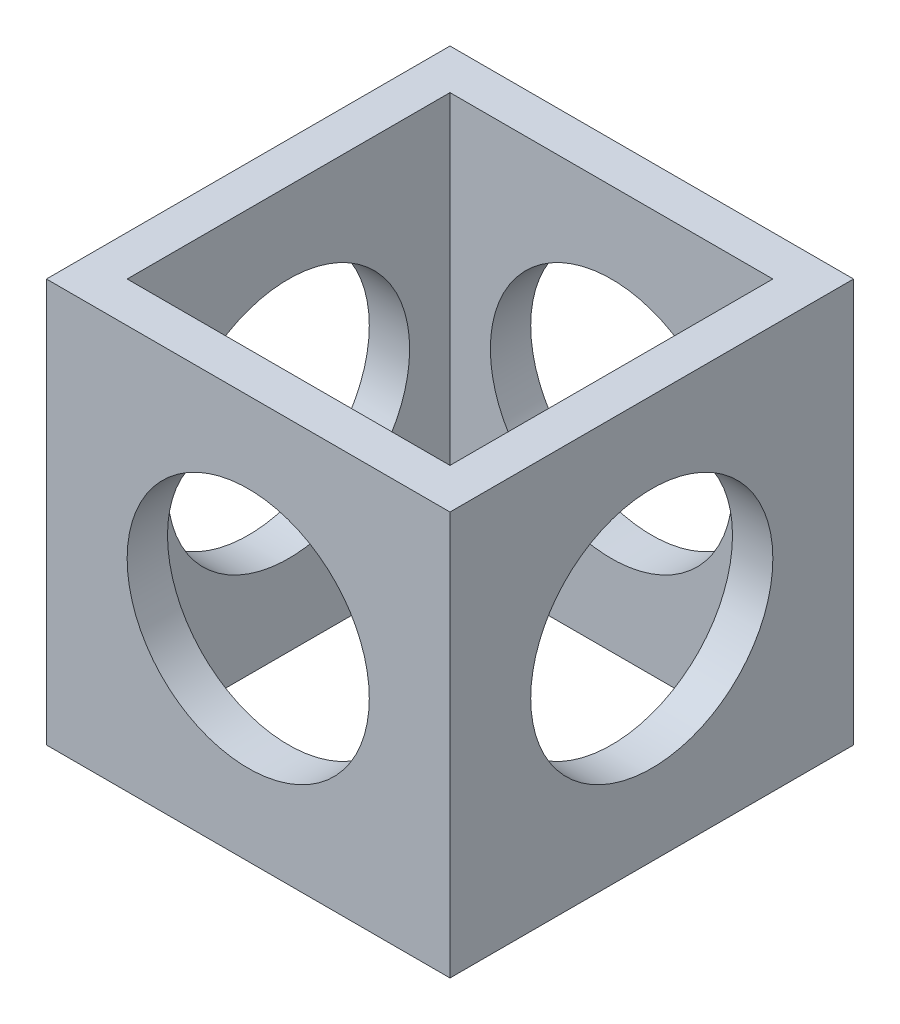
ISO-10303-21;
HEADER;
FILE_DESCRIPTION(('STEP AP214'),'2;1');
FILE_NAME('part.step','',(''),(''),'','','');
FILE_SCHEMA(('AUTOMOTIVE_DESIGN { 1 0 10303 214 1 1 1 1 }'));
ENDSEC;
DATA;
#1=APPLICATION_CONTEXT('core data for automotive mechanical design processes');
#2=APPLICATION_PROTOCOL_DEFINITION('international standard','automotive_design',2000,#1);
#3=PRODUCT_CONTEXT('',#1,'mechanical');
#4=PRODUCT('Part','Part','',(#3));
#5=PRODUCT_RELATED_PRODUCT_CATEGORY('part','',(#4));
#6=PRODUCT_DEFINITION_FORMATION('','',#4);
#7=PRODUCT_DEFINITION_CONTEXT('part definition',#1,'design');
#8=PRODUCT_DEFINITION('design','',#6,#7);
#9=PRODUCT_DEFINITION_SHAPE('','',#8);
#10=(LENGTH_UNIT() NAMED_UNIT(*) SI_UNIT(.MILLI.,.METRE.));
#11=(NAMED_UNIT(*) PLANE_ANGLE_UNIT() SI_UNIT($,.RADIAN.));
#12=(NAMED_UNIT(*) SI_UNIT($,.STERADIAN.) SOLID_ANGLE_UNIT());
#13=UNCERTAINTY_MEASURE_WITH_UNIT(LENGTH_MEASURE(1.E-05),#10,'distance_accuracy_value','');
#14=(GEOMETRIC_REPRESENTATION_CONTEXT(3) GLOBAL_UNCERTAINTY_ASSIGNED_CONTEXT((#13)) GLOBAL_UNIT_ASSIGNED_CONTEXT((#10,
#11,#12)) REPRESENTATION_CONTEXT('',''));
#15=CARTESIAN_POINT('',(0.,0.,0.));
#16=DIRECTION('',(0.,0.,1.));
#17=DIRECTION('',(1.,0.,0.));
#18=AXIS2_PLACEMENT_3D('',#15,#16,#17);
#19=CARTESIAN_POINT('',(-50.,25.,-25.));
#20=DIRECTION('',(0.,0.,-1.));
#21=DIRECTION('',(0.,1.,0.));
#22=AXIS2_PLACEMENT_3D('',#19,#20,#21);
#23=PLANE('',#22);
#24=CARTESIAN_POINT('',(-25.,0.,-25.));
#25=DIRECTION('',(0.,0.,1.));
#26=DIRECTION('',(1.,0.,0.));
#27=AXIS2_PLACEMENT_3D('',#24,#25,#26);
#28=CIRCLE('',#27,15.);
#29=CARTESIAN_POINT('',(-9.99999999999999,0.,-25.));
#30=VERTEX_POINT('',#29);
#31=EDGE_CURVE('E182',#30,#30,#28,.T.);
#32=ORIENTED_EDGE('',*,*,#31,.T.);
#33=EDGE_LOOP('',(#32));
#34=FACE_BOUND('',#33,.T.);
#35=DIRECTION('',(0.,1.,0.));
#36=VECTOR('',#35,1.);
#37=CARTESIAN_POINT('',(0.,25.,-25.));
#38=LINE('',#37,#36);
#39=CARTESIAN_POINT('',(0.,-25.,-25.));
#40=VERTEX_POINT('',#39);
#41=CARTESIAN_POINT('',(0.,25.,-25.));
#42=VERTEX_POINT('',#41);
#43=EDGE_CURVE('E135',#40,#42,#38,.T.);
#44=ORIENTED_EDGE('',*,*,#43,.F.);
#45=DIRECTION('',(1.,0.,0.));
#46=VECTOR('',#45,1.);
#47=CARTESIAN_POINT('',(-50.,-25.,-25.));
#48=LINE('',#47,#46);
#49=CARTESIAN_POINT('',(-50.,-25.,-25.));
#50=VERTEX_POINT('',#49);
#51=EDGE_CURVE('E11',#50,#40,#48,.T.);
#52=ORIENTED_EDGE('',*,*,#51,.F.);
#53=DIRECTION('',(0.,1.,0.));
#54=VECTOR('',#53,1.);
#55=CARTESIAN_POINT('',(-50.,25.,-25.));
#56=LINE('',#55,#54);
#57=CARTESIAN_POINT('',(-50.,25.,-25.));
#58=VERTEX_POINT('',#57);
#59=EDGE_CURVE('E139',#50,#58,#56,.T.);
#60=ORIENTED_EDGE('',*,*,#59,.T.);
#61=DIRECTION('',(1.,0.,0.));
#62=VECTOR('',#61,1.);
#63=CARTESIAN_POINT('',(-50.,25.,-25.));
#64=LINE('',#63,#62);
#65=EDGE_CURVE('E152',#58,#42,#64,.T.);
#66=ORIENTED_EDGE('',*,*,#65,.T.);
#67=EDGE_LOOP('',(#44,#52,#60,#66));
#68=FACE_BOUND('',#67,.T.);
#69=ADVANCED_FACE('F34',(#34,#68),#23,.T.);
#70=CARTESIAN_POINT('',(-50.,-25.,25.));
#71=DIRECTION('',(0.,-1.,0.));
#72=DIRECTION('',(0.,0.,-1.));
#73=AXIS2_PLACEMENT_3D('',#70,#71,#72);
#74=PLANE('',#73);
#75=DIRECTION('',(0.,0.,-1.));
#76=VECTOR('',#75,1.);
#77=CARTESIAN_POINT('',(-5.,-25.,-20.));
#78=LINE('',#77,#76);
#79=CARTESIAN_POINT('',(-5.,-25.,20.));
#80=VERTEX_POINT('',#79);
#81=CARTESIAN_POINT('',(-5.,-25.,-20.));
#82=VERTEX_POINT('',#81);
#83=EDGE_CURVE('E101',#80,#82,#78,.T.);
#84=ORIENTED_EDGE('',*,*,#83,.T.);
#85=DIRECTION('',(-1.,0.,0.));
#86=VECTOR('',#85,1.);
#87=CARTESIAN_POINT('',(-45.,-25.,-20.));
#88=LINE('',#87,#86);
#89=CARTESIAN_POINT('',(-45.,-25.,-20.));
#90=VERTEX_POINT('',#89);
#91=EDGE_CURVE('E110',#82,#90,#88,.T.);
#92=ORIENTED_EDGE('',*,*,#91,.T.);
#93=DIRECTION('',(0.,0.,1.));
#94=VECTOR('',#93,1.);
#95=CARTESIAN_POINT('',(-45.,-25.,-20.));
#96=LINE('',#95,#94);
#97=CARTESIAN_POINT('',(-45.,-25.,20.));
#98=VERTEX_POINT('',#97);
#99=EDGE_CURVE('E50',#90,#98,#96,.T.);
#100=ORIENTED_EDGE('',*,*,#99,.T.);
#101=DIRECTION('',(1.,0.,0.));
#102=VECTOR('',#101,1.);
#103=CARTESIAN_POINT('',(-45.,-25.,20.));
#104=LINE('',#103,#102);
#105=EDGE_CURVE('E107',#98,#80,#104,.T.);
#106=ORIENTED_EDGE('',*,*,#105,.T.);
#107=EDGE_LOOP('',(#84,#92,#100,#106));
#108=FACE_BOUND('',#107,.T.);
#109=DIRECTION('',(0.,0.,-1.));
#110=VECTOR('',#109,1.);
#111=CARTESIAN_POINT('',(0.,-25.,25.));
#112=LINE('',#111,#110);
#113=CARTESIAN_POINT('',(0.,-25.,25.));
#114=VERTEX_POINT('',#113);
#115=EDGE_CURVE('E143',#114,#40,#112,.T.);
#116=ORIENTED_EDGE('',*,*,#115,.F.);
#117=DIRECTION('',(1.,0.,0.));
#118=VECTOR('',#117,1.);
#119=CARTESIAN_POINT('',(-50.,-25.,25.));
#120=LINE('',#119,#118);
#121=CARTESIAN_POINT('',(-50.,-25.,25.));
#122=VERTEX_POINT('',#121);
#123=EDGE_CURVE('E42',#122,#114,#120,.T.);
#124=ORIENTED_EDGE('',*,*,#123,.F.);
#125=DIRECTION('',(0.,0.,-1.));
#126=VECTOR('',#125,1.);
#127=CARTESIAN_POINT('',(-50.,-25.,25.));
#128=LINE('',#127,#126);
#129=EDGE_CURVE('E149',#122,#50,#128,.T.);
#130=ORIENTED_EDGE('',*,*,#129,.T.);
#131=ORIENTED_EDGE('',*,*,#51,.T.);
#132=EDGE_LOOP('',(#116,#124,#130,#131));
#133=FACE_BOUND('',#132,.T.);
#134=ADVANCED_FACE('F114',(#108,#133),#74,.T.);
#135=CARTESIAN_POINT('',(-50.,25.,25.));
#136=DIRECTION('',(0.,0.,1.));
#137=DIRECTION('',(0.,-1.,0.));
#138=AXIS2_PLACEMENT_3D('',#135,#136,#137);
#139=PLANE('',#138);
#140=CARTESIAN_POINT('',(-25.,0.,25.));
#141=DIRECTION('',(0.,0.,1.));
#142=DIRECTION('',(1.,0.,0.));
#143=AXIS2_PLACEMENT_3D('',#140,#141,#142);
#144=CIRCLE('',#143,15.);
#145=CARTESIAN_POINT('',(-10.,0.,25.));
#146=VERTEX_POINT('',#145);
#147=EDGE_CURVE('E185',#146,#146,#144,.T.);
#148=ORIENTED_EDGE('',*,*,#147,.F.);
#149=EDGE_LOOP('',(#148));
#150=FACE_BOUND('',#149,.T.);
#151=DIRECTION('',(0.,-1.,0.));
#152=VECTOR('',#151,1.);
#153=CARTESIAN_POINT('',(0.,25.,25.));
#154=LINE('',#153,#152);
#155=CARTESIAN_POINT('',(0.,25.,25.));
#156=VERTEX_POINT('',#155);
#157=EDGE_CURVE('E158',#156,#114,#154,.T.);
#158=ORIENTED_EDGE('',*,*,#157,.F.);
#159=DIRECTION('',(1.,0.,0.));
#160=VECTOR('',#159,1.);
#161=CARTESIAN_POINT('',(-50.,25.,25.));
#162=LINE('',#161,#160);
#163=CARTESIAN_POINT('',(-50.,25.,25.));
#164=VERTEX_POINT('',#163);
#165=EDGE_CURVE('E164',#164,#156,#162,.T.);
#166=ORIENTED_EDGE('',*,*,#165,.F.);
#167=DIRECTION('',(0.,-1.,0.));
#168=VECTOR('',#167,1.);
#169=CARTESIAN_POINT('',(-50.,25.,25.));
#170=LINE('',#169,#168);
#171=EDGE_CURVE('E146',#164,#122,#170,.T.);
#172=ORIENTED_EDGE('',*,*,#171,.T.);
#173=ORIENTED_EDGE('',*,*,#123,.T.);
#174=EDGE_LOOP('',(#158,#166,#172,#173));
#175=FACE_BOUND('',#174,.T.);
#176=ADVANCED_FACE('F213',(#150,#175),#139,.T.);
#177=CARTESIAN_POINT('',(-50.,25.,25.));
#178=DIRECTION('',(0.,1.,0.));
#179=DIRECTION('',(0.,0.,1.));
#180=AXIS2_PLACEMENT_3D('',#177,#178,#179);
#181=PLANE('',#180);
#182=DIRECTION('',(0.,0.,-1.));
#183=VECTOR('',#182,1.);
#184=CARTESIAN_POINT('',(-5.,25.,-20.));
#185=LINE('',#184,#183);
#186=CARTESIAN_POINT('',(-5.,25.,20.));
#187=VERTEX_POINT('',#186);
#188=CARTESIAN_POINT('',(-5.,25.,-20.));
#189=VERTEX_POINT('',#188);
#190=EDGE_CURVE('E58',#187,#189,#185,.T.);
#191=ORIENTED_EDGE('',*,*,#190,.F.);
#192=DIRECTION('',(1.,0.,0.));
#193=VECTOR('',#192,1.);
#194=CARTESIAN_POINT('',(-45.,25.,20.));
#195=LINE('',#194,#193);
#196=CARTESIAN_POINT('',(-45.,25.,20.));
#197=VERTEX_POINT('',#196);
#198=EDGE_CURVE('E117',#197,#187,#195,.T.);
#199=ORIENTED_EDGE('',*,*,#198,.F.);
#200=DIRECTION('',(0.,0.,1.));
#201=VECTOR('',#200,1.);
#202=CARTESIAN_POINT('',(-45.,25.,-20.));
#203=LINE('',#202,#201);
#204=CARTESIAN_POINT('',(-45.,25.,-20.));
#205=VERTEX_POINT('',#204);
#206=EDGE_CURVE('E120',#205,#197,#203,.T.);
#207=ORIENTED_EDGE('',*,*,#206,.F.);
#208=DIRECTION('',(-1.,0.,0.));
#209=VECTOR('',#208,1.);
#210=CARTESIAN_POINT('',(-45.,25.,-20.));
#211=LINE('',#210,#209);
#212=EDGE_CURVE('E129',#189,#205,#211,.T.);
#213=ORIENTED_EDGE('',*,*,#212,.F.);
#214=EDGE_LOOP('',(#191,#199,#207,#213));
#215=FACE_BOUND('',#214,.T.);
#216=DIRECTION('',(0.,0.,1.));
#217=VECTOR('',#216,1.);
#218=CARTESIAN_POINT('',(0.,25.,25.));
#219=LINE('',#218,#217);
#220=EDGE_CURVE('E155',#42,#156,#219,.T.);
#221=ORIENTED_EDGE('',*,*,#220,.F.);
#222=ORIENTED_EDGE('',*,*,#65,.F.);
#223=DIRECTION('',(0.,0.,1.));
#224=VECTOR('',#223,1.);
#225=CARTESIAN_POINT('',(-50.,25.,25.));
#226=LINE('',#225,#224);
#227=EDGE_CURVE('E142',#58,#164,#226,.T.);
#228=ORIENTED_EDGE('',*,*,#227,.T.);
#229=ORIENTED_EDGE('',*,*,#165,.T.);
#230=EDGE_LOOP('',(#221,#222,#228,#229));
#231=FACE_BOUND('',#230,.T.);
#232=ADVANCED_FACE('F230',(#215,#231),#181,.T.);
#233=CARTESIAN_POINT('',(-50.,0.,0.));
#234=DIRECTION('',(1.,0.,0.));
#235=DIRECTION('',(0.,0.,-1.));
#236=AXIS2_PLACEMENT_3D('',#233,#234,#235);
#237=PLANE('',#236);
#238=CARTESIAN_POINT('',(-50.,0.,0.));
#239=DIRECTION('',(1.,0.,0.));
#240=DIRECTION('',(0.,0.,-1.));
#241=AXIS2_PLACEMENT_3D('',#238,#239,#240);
#242=CIRCLE('',#241,15.);
#243=CARTESIAN_POINT('',(-50.,0.,-15.));
#244=VERTEX_POINT('',#243);
#245=EDGE_CURVE('E168',#244,#244,#242,.T.);
#246=ORIENTED_EDGE('',*,*,#245,.T.);
#247=EDGE_LOOP('',(#246));
#248=FACE_BOUND('',#247,.T.);
#249=ORIENTED_EDGE('',*,*,#59,.F.);
#250=ORIENTED_EDGE('',*,*,#129,.F.);
#251=ORIENTED_EDGE('',*,*,#171,.F.);
#252=ORIENTED_EDGE('',*,*,#227,.F.);
#253=EDGE_LOOP('',(#249,#250,#251,#252));
#254=FACE_BOUND('',#253,.T.);
#255=ADVANCED_FACE('F227',(#248,#254),#237,.F.);
#256=CARTESIAN_POINT('',(0.,0.,0.));
#257=DIRECTION('',(1.,0.,0.));
#258=DIRECTION('',(0.,0.,-1.));
#259=AXIS2_PLACEMENT_3D('',#256,#257,#258);
#260=PLANE('',#259);
#261=CARTESIAN_POINT('',(0.,0.,0.));
#262=DIRECTION('',(1.,0.,0.));
#263=DIRECTION('',(0.,0.,-1.));
#264=AXIS2_PLACEMENT_3D('',#261,#262,#263);
#265=CIRCLE('',#264,15.);
#266=CARTESIAN_POINT('',(0.,0.,-15.));
#267=VERTEX_POINT('',#266);
#268=EDGE_CURVE('E173',#267,#267,#265,.T.);
#269=ORIENTED_EDGE('',*,*,#268,.F.);
#270=EDGE_LOOP('',(#269));
#271=FACE_BOUND('',#270,.T.);
#272=ORIENTED_EDGE('',*,*,#43,.T.);
#273=ORIENTED_EDGE('',*,*,#220,.T.);
#274=ORIENTED_EDGE('',*,*,#157,.T.);
#275=ORIENTED_EDGE('',*,*,#115,.T.);
#276=EDGE_LOOP('',(#272,#273,#274,#275));
#277=FACE_BOUND('',#276,.T.);
#278=ADVANCED_FACE('F222',(#271,#277),#260,.T.);
#279=CARTESIAN_POINT('',(-5.,-25.,-20.));
#280=DIRECTION('',(1.,0.,0.));
#281=DIRECTION('',(0.,0.,-1.));
#282=AXIS2_PLACEMENT_3D('',#279,#280,#281);
#283=PLANE('',#282);
#284=CARTESIAN_POINT('',(-5.,0.,0.));
#285=DIRECTION('',(1.,0.,0.));
#286=DIRECTION('',(0.,0.,-1.));
#287=AXIS2_PLACEMENT_3D('',#284,#285,#286);
#288=CIRCLE('',#287,15.);
#289=CARTESIAN_POINT('',(-5.00000000000001,0.,-15.));
#290=VERTEX_POINT('',#289);
#291=EDGE_CURVE('E123',#290,#290,#288,.T.);
#292=ORIENTED_EDGE('',*,*,#291,.T.);
#293=EDGE_LOOP('',(#292));
#294=FACE_BOUND('',#293,.T.);
#295=ORIENTED_EDGE('',*,*,#190,.T.);
#296=DIRECTION('',(0.,1.,0.));
#297=VECTOR('',#296,1.);
#298=CARTESIAN_POINT('',(-5.,-25.,-20.));
#299=LINE('',#298,#297);
#300=EDGE_CURVE('E97',#82,#189,#299,.T.);
#301=ORIENTED_EDGE('',*,*,#300,.F.);
#302=ORIENTED_EDGE('',*,*,#83,.F.);
#303=DIRECTION('',(0.,1.,0.));
#304=VECTOR('',#303,1.);
#305=CARTESIAN_POINT('',(-5.,-25.,20.));
#306=LINE('',#305,#304);
#307=EDGE_CURVE('E133',#80,#187,#306,.T.);
#308=ORIENTED_EDGE('',*,*,#307,.T.);
#309=EDGE_LOOP('',(#295,#301,#302,#308));
#310=FACE_BOUND('',#309,.T.);
#311=ADVANCED_FACE('F99',(#294,#310),#283,.F.);
#312=CARTESIAN_POINT('',(-45.,-25.,20.));
#313=DIRECTION('',(0.,0.,1.));
#314=DIRECTION('',(1.,0.,0.));
#315=AXIS2_PLACEMENT_3D('',#312,#313,#314);
#316=PLANE('',#315);
#317=CARTESIAN_POINT('',(-25.,0.,20.));
#318=DIRECTION('',(0.,0.,1.));
#319=DIRECTION('',(1.,0.,0.));
#320=AXIS2_PLACEMENT_3D('',#317,#318,#319);
#321=CIRCLE('',#320,15.);
#322=CARTESIAN_POINT('',(-10.,0.,20.));
#323=VERTEX_POINT('',#322);
#324=EDGE_CURVE('E178',#323,#323,#321,.F.);
#325=ORIENTED_EDGE('',*,*,#324,.F.);
#326=EDGE_LOOP('',(#325));
#327=FACE_BOUND('',#326,.T.);
#328=ORIENTED_EDGE('',*,*,#198,.T.);
#329=ORIENTED_EDGE('',*,*,#307,.F.);
#330=ORIENTED_EDGE('',*,*,#105,.F.);
#331=DIRECTION('',(0.,1.,0.));
#332=VECTOR('',#331,1.);
#333=CARTESIAN_POINT('',(-45.,-25.,20.));
#334=LINE('',#333,#332);
#335=EDGE_CURVE('E136',#98,#197,#334,.T.);
#336=ORIENTED_EDGE('',*,*,#335,.T.);
#337=EDGE_LOOP('',(#328,#329,#330,#336));
#338=FACE_BOUND('',#337,.T.);
#339=ADVANCED_FACE('F205',(#327,#338),#316,.F.);
#340=CARTESIAN_POINT('',(-45.,-25.,-20.));
#341=DIRECTION('',(-1.,0.,0.));
#342=DIRECTION('',(0.,0.,1.));
#343=AXIS2_PLACEMENT_3D('',#340,#341,#342);
#344=PLANE('',#343);
#345=CARTESIAN_POINT('',(-45.,0.,0.));
#346=DIRECTION('',(-1.,0.,0.));
#347=DIRECTION('',(0.,0.,1.));
#348=AXIS2_PLACEMENT_3D('',#345,#346,#347);
#349=CIRCLE('',#348,15.);
#350=CARTESIAN_POINT('',(-45.,0.,15.));
#351=VERTEX_POINT('',#350);
#352=EDGE_CURVE('E166',#351,#351,#349,.T.);
#353=ORIENTED_EDGE('',*,*,#352,.T.);
#354=EDGE_LOOP('',(#353));
#355=FACE_BOUND('',#354,.T.);
#356=ORIENTED_EDGE('',*,*,#206,.T.);
#357=ORIENTED_EDGE('',*,*,#335,.F.);
#358=ORIENTED_EDGE('',*,*,#99,.F.);
#359=DIRECTION('',(0.,1.,0.));
#360=VECTOR('',#359,1.);
#361=CARTESIAN_POINT('',(-45.,-25.,-20.));
#362=LINE('',#361,#360);
#363=EDGE_CURVE('E106',#90,#205,#362,.T.);
#364=ORIENTED_EDGE('',*,*,#363,.T.);
#365=EDGE_LOOP('',(#356,#357,#358,#364));
#366=FACE_BOUND('',#365,.T.);
#367=ADVANCED_FACE('F196',(#355,#366),#344,.F.);
#368=CARTESIAN_POINT('',(-45.,-25.,-20.));
#369=DIRECTION('',(0.,0.,-1.));
#370=DIRECTION('',(-1.,0.,0.));
#371=AXIS2_PLACEMENT_3D('',#368,#369,#370);
#372=PLANE('',#371);
#373=CARTESIAN_POINT('',(-25.,0.,-20.));
#374=DIRECTION('',(0.,0.,-1.));
#375=DIRECTION('',(-1.,0.,0.));
#376=AXIS2_PLACEMENT_3D('',#373,#374,#375);
#377=CIRCLE('',#376,15.);
#378=CARTESIAN_POINT('',(-40.,0.,-20.));
#379=VERTEX_POINT('',#378);
#380=EDGE_CURVE('E37',#379,#379,#377,.F.);
#381=ORIENTED_EDGE('',*,*,#380,.F.);
#382=EDGE_LOOP('',(#381));
#383=FACE_BOUND('',#382,.T.);
#384=ORIENTED_EDGE('',*,*,#212,.T.);
#385=ORIENTED_EDGE('',*,*,#363,.F.);
#386=ORIENTED_EDGE('',*,*,#91,.F.);
#387=ORIENTED_EDGE('',*,*,#300,.T.);
#388=EDGE_LOOP('',(#384,#385,#386,#387));
#389=FACE_BOUND('',#388,.T.);
#390=ADVANCED_FACE('F111',(#383,#389),#372,.F.);
#391=CARTESIAN_POINT('',(-50.,0.,0.));
#392=DIRECTION('',(1.,0.,0.));
#393=DIRECTION('',(0.,0.,-1.));
#394=AXIS2_PLACEMENT_3D('',#391,#392,#393);
#395=CYLINDRICAL_SURFACE('',#394,15.);
#396=ORIENTED_EDGE('',*,*,#245,.F.);
#397=EDGE_LOOP('',(#396));
#398=FACE_BOUND('',#397,.T.);
#399=ORIENTED_EDGE('',*,*,#352,.F.);
#400=EDGE_LOOP('',(#399));
#401=FACE_BOUND('',#400,.T.);
#402=ADVANCED_FACE('F195',(#398,#401),#395,.F.);
#403=ORIENTED_EDGE('',*,*,#268,.T.);
#404=EDGE_LOOP('',(#403));
#405=FACE_BOUND('',#404,.T.);
#406=ORIENTED_EDGE('',*,*,#291,.F.);
#407=EDGE_LOOP('',(#406));
#408=FACE_BOUND('',#407,.T.);
#409=ADVANCED_FACE('F202',(#405,#408),#395,.F.);
#410=CARTESIAN_POINT('',(-25.,0.,25.));
#411=DIRECTION('',(0.,0.,-1.));
#412=DIRECTION('',(-1.,0.,0.));
#413=AXIS2_PLACEMENT_3D('',#410,#411,#412);
#414=CYLINDRICAL_SURFACE('',#413,15.);
#415=ORIENTED_EDGE('',*,*,#31,.F.);
#416=EDGE_LOOP('',(#415));
#417=FACE_BOUND('',#416,.T.);
#418=ORIENTED_EDGE('',*,*,#380,.T.);
#419=EDGE_LOOP('',(#418));
#420=FACE_BOUND('',#419,.T.);
#421=ADVANCED_FACE('F192',(#417,#420),#414,.F.);
#422=ORIENTED_EDGE('',*,*,#147,.T.);
#423=EDGE_LOOP('',(#422));
#424=FACE_BOUND('',#423,.T.);
#425=ORIENTED_EDGE('',*,*,#324,.T.);
#426=EDGE_LOOP('',(#425));
#427=FACE_BOUND('',#426,.T.);
#428=ADVANCED_FACE('F258',(#424,#427),#414,.F.);
#429=CLOSED_SHELL('',(#69,#134,#176,#232,#255,#278,#311,#339,#367,#390,#402,#409,#421,#428));
#430=MANIFOLD_SOLID_BREP('B2',#429);
#431=ADVANCED_BREP_SHAPE_REPRESENTATION('',(#18,#430),#14);
#432=SHAPE_DEFINITION_REPRESENTATION(#9,#431);
ENDSEC;
END-ISO-10303-21;
